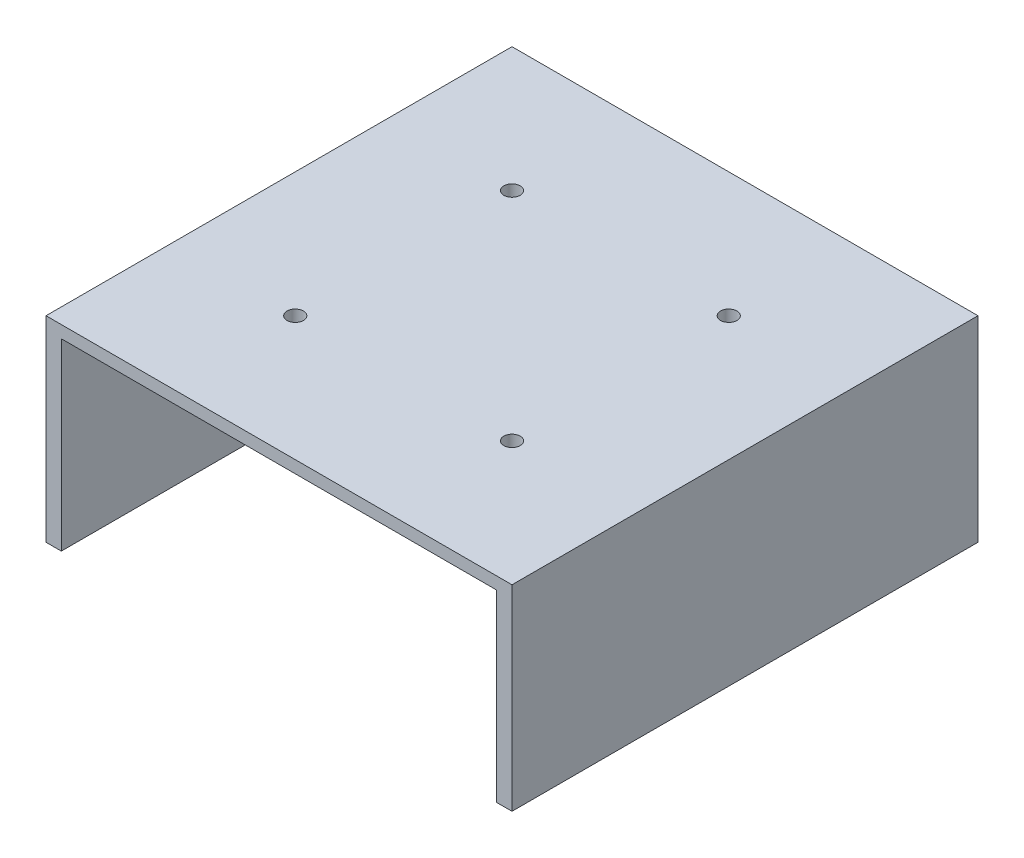
ISO-10303-21;
HEADER;
FILE_DESCRIPTION(('STEP AP214'),'2;1');
FILE_NAME('part.step','',(''),(''),'','','');
FILE_SCHEMA(('AUTOMOTIVE_DESIGN { 1 0 10303 214 1 1 1 1 }'));
ENDSEC;
DATA;
#1=APPLICATION_CONTEXT('core data for automotive mechanical design processes');
#2=APPLICATION_PROTOCOL_DEFINITION('international standard','automotive_design',2000,#1);
#3=PRODUCT_CONTEXT('',#1,'mechanical');
#4=PRODUCT('Part','Part','',(#3));
#5=PRODUCT_RELATED_PRODUCT_CATEGORY('part','',(#4));
#6=PRODUCT_DEFINITION_FORMATION('','',#4);
#7=PRODUCT_DEFINITION_CONTEXT('part definition',#1,'design');
#8=PRODUCT_DEFINITION('design','',#6,#7);
#9=PRODUCT_DEFINITION_SHAPE('','',#8);
#10=(LENGTH_UNIT() NAMED_UNIT(*) SI_UNIT(.MILLI.,.METRE.));
#11=(NAMED_UNIT(*) PLANE_ANGLE_UNIT() SI_UNIT($,.RADIAN.));
#12=(NAMED_UNIT(*) SI_UNIT($,.STERADIAN.) SOLID_ANGLE_UNIT());
#13=UNCERTAINTY_MEASURE_WITH_UNIT(LENGTH_MEASURE(1.E-05),#10,'distance_accuracy_value','');
#14=(GEOMETRIC_REPRESENTATION_CONTEXT(3) GLOBAL_UNCERTAINTY_ASSIGNED_CONTEXT((#13)) GLOBAL_UNIT_ASSIGNED_CONTEXT((#10,
#11,#12)) REPRESENTATION_CONTEXT('',''));
#15=CARTESIAN_POINT('',(0.,0.,0.));
#16=DIRECTION('',(0.,0.,1.));
#17=DIRECTION('',(1.,0.,0.));
#18=AXIS2_PLACEMENT_3D('',#15,#16,#17);
#19=CARTESIAN_POINT('',(0.,0.,0.));
#20=DIRECTION('',(0.,1.,0.));
#21=DIRECTION('',(0.,0.,1.));
#22=AXIS2_PLACEMENT_3D('',#19,#20,#21);
#23=PLANE('',#22);
#24=CARTESIAN_POINT('',(-22.4478830679846,0.,-22.4478830679846));
#25=DIRECTION('',(0.,1.,0.));
#26=DIRECTION('',(0.,0.,1.));
#27=AXIS2_PLACEMENT_3D('',#24,#25,#26);
#28=CIRCLE('',#27,1.7);
#29=CARTESIAN_POINT('',(-22.4478830679846,0.,-20.7478830679846));
#30=VERTEX_POINT('',#29);
#31=EDGE_CURVE('E142',#30,#30,#28,.T.);
#32=ORIENTED_EDGE('',*,*,#31,.T.);
#33=EDGE_LOOP('',(#32));
#34=FACE_BOUND('',#33,.T.);
#35=CARTESIAN_POINT('',(22.4478830679847,0.,-22.4478830679846));
#36=DIRECTION('',(0.,1.,0.));
#37=DIRECTION('',(0.,0.,1.));
#38=AXIS2_PLACEMENT_3D('',#35,#36,#37);
#39=CIRCLE('',#38,1.7);
#40=CARTESIAN_POINT('',(22.4478830679847,0.,-20.7478830679846));
#41=VERTEX_POINT('',#40);
#42=EDGE_CURVE('E204',#41,#41,#39,.T.);
#43=ORIENTED_EDGE('',*,*,#42,.T.);
#44=EDGE_LOOP('',(#43));
#45=FACE_BOUND('',#44,.T.);
#46=CARTESIAN_POINT('',(22.4478830679847,0.,22.4478830679846));
#47=DIRECTION('',(0.,1.,0.));
#48=DIRECTION('',(0.,0.,1.));
#49=AXIS2_PLACEMENT_3D('',#46,#47,#48);
#50=CIRCLE('',#49,1.7);
#51=CARTESIAN_POINT('',(22.4478830679847,0.,24.1478830679846));
#52=VERTEX_POINT('',#51);
#53=EDGE_CURVE('E196',#52,#52,#50,.T.);
#54=ORIENTED_EDGE('',*,*,#53,.T.);
#55=EDGE_LOOP('',(#54));
#56=FACE_BOUND('',#55,.T.);
#57=CARTESIAN_POINT('',(-22.4478830679847,0.,22.4478830679846));
#58=DIRECTION('',(0.,1.,0.));
#59=DIRECTION('',(0.,0.,1.));
#60=AXIS2_PLACEMENT_3D('',#57,#58,#59);
#61=CIRCLE('',#60,1.7);
#62=CARTESIAN_POINT('',(-22.4478830679847,0.,24.1478830679846));
#63=VERTEX_POINT('',#62);
#64=EDGE_CURVE('E191',#63,#63,#61,.T.);
#65=ORIENTED_EDGE('',*,*,#64,.T.);
#66=EDGE_LOOP('',(#65));
#67=FACE_BOUND('',#66,.T.);
#68=DIRECTION('',(0.,0.,-1.));
#69=VECTOR('',#68,1.);
#70=CARTESIAN_POINT('',(45.085,0.,48.26));
#71=LINE('',#70,#69);
#72=CARTESIAN_POINT('',(45.085,0.,48.26));
#73=VERTEX_POINT('',#72);
#74=CARTESIAN_POINT('',(45.085,0.,-48.26));
#75=VERTEX_POINT('',#74);
#76=EDGE_CURVE('E113',#73,#75,#71,.T.);
#77=ORIENTED_EDGE('',*,*,#76,.F.);
#78=DIRECTION('',(1.,0.,0.));
#79=VECTOR('',#78,1.);
#80=CARTESIAN_POINT('',(-48.26,0.,48.26));
#81=LINE('',#80,#79);
#82=CARTESIAN_POINT('',(-45.085,0.,48.26));
#83=VERTEX_POINT('',#82);
#84=EDGE_CURVE('E134',#83,#73,#81,.T.);
#85=ORIENTED_EDGE('',*,*,#84,.F.);
#86=DIRECTION('',(0.,0.,1.));
#87=VECTOR('',#86,1.);
#88=CARTESIAN_POINT('',(-45.085,0.,48.26));
#89=LINE('',#88,#87);
#90=CARTESIAN_POINT('',(-45.085,0.,-48.26));
#91=VERTEX_POINT('',#90);
#92=EDGE_CURVE('E123',#91,#83,#89,.T.);
#93=ORIENTED_EDGE('',*,*,#92,.F.);
#94=DIRECTION('',(-1.,0.,0.));
#95=VECTOR('',#94,1.);
#96=CARTESIAN_POINT('',(-48.26,0.,-48.26));
#97=LINE('',#96,#95);
#98=EDGE_CURVE('E61',#75,#91,#97,.T.);
#99=ORIENTED_EDGE('',*,*,#98,.F.);
#100=EDGE_LOOP('',(#77,#85,#93,#99));
#101=FACE_BOUND('',#100,.T.);
#102=ADVANCED_FACE('F45',(#34,#45,#56,#67,#101),#23,.F.);
#103=CARTESIAN_POINT('',(0.,2.54,0.));
#104=DIRECTION('',(0.,1.,0.));
#105=DIRECTION('',(0.,0.,1.));
#106=AXIS2_PLACEMENT_3D('',#103,#104,#105);
#107=PLANE('',#106);
#108=CARTESIAN_POINT('',(22.4478830679847,2.54,22.4478830679846));
#109=DIRECTION('',(0.,1.,0.));
#110=DIRECTION('',(0.,0.,1.));
#111=AXIS2_PLACEMENT_3D('',#108,#109,#110);
#112=CIRCLE('',#111,1.7);
#113=CARTESIAN_POINT('',(22.4478830679847,2.54,24.1478830679846));
#114=VERTEX_POINT('',#113);
#115=EDGE_CURVE('E200',#114,#114,#112,.T.);
#116=ORIENTED_EDGE('',*,*,#115,.F.);
#117=EDGE_LOOP('',(#116));
#118=FACE_BOUND('',#117,.T.);
#119=CARTESIAN_POINT('',(-22.4478830679846,2.54,-22.4478830679846));
#120=DIRECTION('',(0.,1.,0.));
#121=DIRECTION('',(0.,0.,1.));
#122=AXIS2_PLACEMENT_3D('',#119,#120,#121);
#123=CIRCLE('',#122,1.7);
#124=CARTESIAN_POINT('',(-22.4478830679846,2.54,-20.7478830679846));
#125=VERTEX_POINT('',#124);
#126=EDGE_CURVE('E135',#125,#125,#123,.T.);
#127=ORIENTED_EDGE('',*,*,#126,.F.);
#128=EDGE_LOOP('',(#127));
#129=FACE_BOUND('',#128,.T.);
#130=DIRECTION('',(0.,0.,-1.));
#131=VECTOR('',#130,1.);
#132=CARTESIAN_POINT('',(48.26,2.54,-48.26));
#133=LINE('',#132,#131);
#134=CARTESIAN_POINT('',(48.26,2.54,48.26));
#135=VERTEX_POINT('',#134);
#136=CARTESIAN_POINT('',(48.26,2.54,-48.26));
#137=VERTEX_POINT('',#136);
#138=EDGE_CURVE('E139',#135,#137,#133,.T.);
#139=ORIENTED_EDGE('',*,*,#138,.T.);
#140=DIRECTION('',(-1.,0.,0.));
#141=VECTOR('',#140,1.);
#142=CARTESIAN_POINT('',(-48.26,2.54,-48.26));
#143=LINE('',#142,#141);
#144=CARTESIAN_POINT('',(-48.26,2.54,-48.26));
#145=VERTEX_POINT('',#144);
#146=EDGE_CURVE('E220',#137,#145,#143,.T.);
#147=ORIENTED_EDGE('',*,*,#146,.T.);
#148=DIRECTION('',(0.,0.,1.));
#149=VECTOR('',#148,1.);
#150=CARTESIAN_POINT('',(-48.26,2.54,-48.26));
#151=LINE('',#150,#149);
#152=CARTESIAN_POINT('',(-48.26,2.54,48.26));
#153=VERTEX_POINT('',#152);
#154=EDGE_CURVE('E162',#145,#153,#151,.T.);
#155=ORIENTED_EDGE('',*,*,#154,.T.);
#156=DIRECTION('',(1.,0.,0.));
#157=VECTOR('',#156,1.);
#158=CARTESIAN_POINT('',(-48.26,2.54,48.26));
#159=LINE('',#158,#157);
#160=EDGE_CURVE('E69',#153,#135,#159,.T.);
#161=ORIENTED_EDGE('',*,*,#160,.T.);
#162=EDGE_LOOP('',(#139,#147,#155,#161));
#163=FACE_BOUND('',#162,.T.);
#164=CARTESIAN_POINT('',(22.4478830679847,2.54,-22.4478830679846));
#165=DIRECTION('',(0.,1.,0.));
#166=DIRECTION('',(0.,0.,1.));
#167=AXIS2_PLACEMENT_3D('',#164,#165,#166);
#168=CIRCLE('',#167,1.7);
#169=CARTESIAN_POINT('',(22.4478830679847,2.54,-20.7478830679846));
#170=VERTEX_POINT('',#169);
#171=EDGE_CURVE('E208',#170,#170,#168,.T.);
#172=ORIENTED_EDGE('',*,*,#171,.F.);
#173=EDGE_LOOP('',(#172));
#174=FACE_BOUND('',#173,.T.);
#175=CARTESIAN_POINT('',(-22.4478830679847,2.54,22.4478830679846));
#176=DIRECTION('',(0.,1.,0.));
#177=DIRECTION('',(0.,0.,1.));
#178=AXIS2_PLACEMENT_3D('',#175,#176,#177);
#179=CIRCLE('',#178,1.7);
#180=CARTESIAN_POINT('',(-22.4478830679847,2.54,24.1478830679846));
#181=VERTEX_POINT('',#180);
#182=EDGE_CURVE('E192',#181,#181,#179,.T.);
#183=ORIENTED_EDGE('',*,*,#182,.F.);
#184=EDGE_LOOP('',(#183));
#185=FACE_BOUND('',#184,.T.);
#186=ADVANCED_FACE('F224',(#118,#129,#163,#174,#185),#107,.T.);
#187=CARTESIAN_POINT('',(48.26,2.54,-48.26));
#188=DIRECTION('',(-1.,0.,0.));
#189=DIRECTION('',(0.,0.,1.));
#190=AXIS2_PLACEMENT_3D('',#187,#188,#189);
#191=PLANE('',#190);
#192=DIRECTION('',(0.,-1.,0.));
#193=VECTOR('',#192,1.);
#194=CARTESIAN_POINT('',(48.26,2.54,48.26));
#195=LINE('',#194,#193);
#196=CARTESIAN_POINT('',(48.26,-38.1,48.26));
#197=VERTEX_POINT('',#196);
#198=EDGE_CURVE('E147',#135,#197,#195,.T.);
#199=ORIENTED_EDGE('',*,*,#198,.T.);
#200=DIRECTION('',(0.,0.,1.));
#201=VECTOR('',#200,1.);
#202=CARTESIAN_POINT('',(48.26,-38.1,48.26));
#203=LINE('',#202,#201);
#204=CARTESIAN_POINT('',(48.26,-38.1,-48.26));
#205=VERTEX_POINT('',#204);
#206=EDGE_CURVE('E124',#205,#197,#203,.T.);
#207=ORIENTED_EDGE('',*,*,#206,.F.);
#208=DIRECTION('',(0.,-1.,0.));
#209=VECTOR('',#208,1.);
#210=CARTESIAN_POINT('',(48.26,2.54,-48.26));
#211=LINE('',#210,#209);
#212=EDGE_CURVE('E11',#137,#205,#211,.T.);
#213=ORIENTED_EDGE('',*,*,#212,.F.);
#214=ORIENTED_EDGE('',*,*,#138,.F.);
#215=EDGE_LOOP('',(#199,#207,#213,#214));
#216=FACE_BOUND('',#215,.T.);
#217=ADVANCED_FACE('F47',(#216),#191,.F.);
#218=CARTESIAN_POINT('',(-48.26,2.54,-48.26));
#219=DIRECTION('',(0.,0.,1.));
#220=DIRECTION('',(1.,0.,0.));
#221=AXIS2_PLACEMENT_3D('',#218,#219,#220);
#222=PLANE('',#221);
#223=ORIENTED_EDGE('',*,*,#212,.T.);
#224=DIRECTION('',(1.,0.,0.));
#225=VECTOR('',#224,1.);
#226=CARTESIAN_POINT('',(48.26,-38.1,-48.26));
#227=LINE('',#226,#225);
#228=CARTESIAN_POINT('',(45.085,-38.1,-48.26));
#229=VERTEX_POINT('',#228);
#230=EDGE_CURVE('E128',#229,#205,#227,.T.);
#231=ORIENTED_EDGE('',*,*,#230,.F.);
#232=DIRECTION('',(0.,1.,0.));
#233=VECTOR('',#232,1.);
#234=CARTESIAN_POINT('',(45.085,-38.1,-48.26));
#235=LINE('',#234,#233);
#236=EDGE_CURVE('E116',#229,#75,#235,.T.);
#237=ORIENTED_EDGE('',*,*,#236,.T.);
#238=ORIENTED_EDGE('',*,*,#98,.T.);
#239=DIRECTION('',(0.,1.,0.));
#240=VECTOR('',#239,1.);
#241=CARTESIAN_POINT('',(-45.085,-38.1,-48.26));
#242=LINE('',#241,#240);
#243=CARTESIAN_POINT('',(-45.085,-38.1,-48.26));
#244=VERTEX_POINT('',#243);
#245=EDGE_CURVE('E164',#244,#91,#242,.T.);
#246=ORIENTED_EDGE('',*,*,#245,.F.);
#247=DIRECTION('',(1.,0.,0.));
#248=VECTOR('',#247,1.);
#249=CARTESIAN_POINT('',(-48.26,-38.1,-48.26));
#250=LINE('',#249,#248);
#251=CARTESIAN_POINT('',(-48.26,-38.1,-48.26));
#252=VERTEX_POINT('',#251);
#253=EDGE_CURVE('E163',#252,#244,#250,.T.);
#254=ORIENTED_EDGE('',*,*,#253,.F.);
#255=DIRECTION('',(0.,-1.,0.));
#256=VECTOR('',#255,1.);
#257=CARTESIAN_POINT('',(-48.26,2.54,-48.26));
#258=LINE('',#257,#256);
#259=EDGE_CURVE('E54',#145,#252,#258,.T.);
#260=ORIENTED_EDGE('',*,*,#259,.F.);
#261=ORIENTED_EDGE('',*,*,#146,.F.);
#262=EDGE_LOOP('',(#223,#231,#237,#238,#246,#254,#260,#261));
#263=FACE_BOUND('',#262,.T.);
#264=ADVANCED_FACE('F126',(#263),#222,.F.);
#265=CARTESIAN_POINT('',(-48.26,2.54,-48.26));
#266=DIRECTION('',(1.,0.,0.));
#267=DIRECTION('',(0.,0.,-1.));
#268=AXIS2_PLACEMENT_3D('',#265,#266,#267);
#269=PLANE('',#268);
#270=ORIENTED_EDGE('',*,*,#259,.T.);
#271=DIRECTION('',(0.,0.,-1.));
#272=VECTOR('',#271,1.);
#273=CARTESIAN_POINT('',(-48.26,-38.1,48.26));
#274=LINE('',#273,#272);
#275=CARTESIAN_POINT('',(-48.26,-38.1,48.26));
#276=VERTEX_POINT('',#275);
#277=EDGE_CURVE('E161',#276,#252,#274,.T.);
#278=ORIENTED_EDGE('',*,*,#277,.F.);
#279=DIRECTION('',(0.,-1.,0.));
#280=VECTOR('',#279,1.);
#281=CARTESIAN_POINT('',(-48.26,2.54,48.26));
#282=LINE('',#281,#280);
#283=EDGE_CURVE('E150',#153,#276,#282,.T.);
#284=ORIENTED_EDGE('',*,*,#283,.F.);
#285=ORIENTED_EDGE('',*,*,#154,.F.);
#286=EDGE_LOOP('',(#270,#278,#284,#285));
#287=FACE_BOUND('',#286,.T.);
#288=ADVANCED_FACE('F158',(#287),#269,.F.);
#289=CARTESIAN_POINT('',(-48.26,2.54,48.26));
#290=DIRECTION('',(0.,0.,-1.));
#291=DIRECTION('',(-1.,0.,0.));
#292=AXIS2_PLACEMENT_3D('',#289,#290,#291);
#293=PLANE('',#292);
#294=ORIENTED_EDGE('',*,*,#283,.T.);
#295=DIRECTION('',(-1.,0.,0.));
#296=VECTOR('',#295,1.);
#297=CARTESIAN_POINT('',(-48.26,-38.1,48.26));
#298=LINE('',#297,#296);
#299=CARTESIAN_POINT('',(-45.085,-38.1,48.26));
#300=VERTEX_POINT('',#299);
#301=EDGE_CURVE('E173',#300,#276,#298,.T.);
#302=ORIENTED_EDGE('',*,*,#301,.F.);
#303=DIRECTION('',(0.,1.,0.));
#304=VECTOR('',#303,1.);
#305=CARTESIAN_POINT('',(-45.085,-38.1,48.26));
#306=LINE('',#305,#304);
#307=EDGE_CURVE('E184',#300,#83,#306,.T.);
#308=ORIENTED_EDGE('',*,*,#307,.T.);
#309=ORIENTED_EDGE('',*,*,#84,.T.);
#310=DIRECTION('',(0.,1.,0.));
#311=VECTOR('',#310,1.);
#312=CARTESIAN_POINT('',(45.085,-38.1,48.26));
#313=LINE('',#312,#311);
#314=CARTESIAN_POINT('',(45.085,-38.1,48.26));
#315=VERTEX_POINT('',#314);
#316=EDGE_CURVE('E119',#315,#73,#313,.T.);
#317=ORIENTED_EDGE('',*,*,#316,.F.);
#318=DIRECTION('',(-1.,0.,0.));
#319=VECTOR('',#318,1.);
#320=CARTESIAN_POINT('',(48.26,-38.1,48.26));
#321=LINE('',#320,#319);
#322=EDGE_CURVE('E230',#197,#315,#321,.T.);
#323=ORIENTED_EDGE('',*,*,#322,.F.);
#324=ORIENTED_EDGE('',*,*,#198,.F.);
#325=ORIENTED_EDGE('',*,*,#160,.F.);
#326=EDGE_LOOP('',(#294,#302,#308,#309,#317,#323,#324,#325));
#327=FACE_BOUND('',#326,.T.);
#328=ADVANCED_FACE('F227',(#327),#293,.F.);
#329=CARTESIAN_POINT('',(-22.4478830679846,2.54,-22.4478830679846));
#330=DIRECTION('',(0.,-1.,0.));
#331=DIRECTION('',(0.,0.,-1.));
#332=AXIS2_PLACEMENT_3D('',#329,#330,#331);
#333=CYLINDRICAL_SURFACE('',#332,1.7);
#334=ORIENTED_EDGE('',*,*,#126,.T.);
#335=EDGE_LOOP('',(#334));
#336=FACE_BOUND('',#335,.T.);
#337=ORIENTED_EDGE('',*,*,#31,.F.);
#338=EDGE_LOOP('',(#337));
#339=FACE_BOUND('',#338,.T.);
#340=ADVANCED_FACE('F274',(#336,#339),#333,.F.);
#341=CARTESIAN_POINT('',(22.4478830679847,2.54,-22.4478830679846));
#342=DIRECTION('',(0.,-1.,0.));
#343=DIRECTION('',(0.,0.,-1.));
#344=AXIS2_PLACEMENT_3D('',#341,#342,#343);
#345=CYLINDRICAL_SURFACE('',#344,1.7);
#346=ORIENTED_EDGE('',*,*,#171,.T.);
#347=EDGE_LOOP('',(#346));
#348=FACE_BOUND('',#347,.T.);
#349=ORIENTED_EDGE('',*,*,#42,.F.);
#350=EDGE_LOOP('',(#349));
#351=FACE_BOUND('',#350,.T.);
#352=ADVANCED_FACE('F357',(#348,#351),#345,.F.);
#353=CARTESIAN_POINT('',(22.4478830679847,2.54,22.4478830679846));
#354=DIRECTION('',(0.,-1.,0.));
#355=DIRECTION('',(0.,0.,-1.));
#356=AXIS2_PLACEMENT_3D('',#353,#354,#355);
#357=CYLINDRICAL_SURFACE('',#356,1.7);
#358=ORIENTED_EDGE('',*,*,#115,.T.);
#359=EDGE_LOOP('',(#358));
#360=FACE_BOUND('',#359,.T.);
#361=ORIENTED_EDGE('',*,*,#53,.F.);
#362=EDGE_LOOP('',(#361));
#363=FACE_BOUND('',#362,.T.);
#364=ADVANCED_FACE('F258',(#360,#363),#357,.F.);
#365=CARTESIAN_POINT('',(-22.4478830679847,2.54,22.4478830679846));
#366=DIRECTION('',(0.,-1.,0.));
#367=DIRECTION('',(0.,0.,-1.));
#368=AXIS2_PLACEMENT_3D('',#365,#366,#367);
#369=CYLINDRICAL_SURFACE('',#368,1.7);
#370=ORIENTED_EDGE('',*,*,#182,.T.);
#371=EDGE_LOOP('',(#370));
#372=FACE_BOUND('',#371,.T.);
#373=ORIENTED_EDGE('',*,*,#64,.F.);
#374=EDGE_LOOP('',(#373));
#375=FACE_BOUND('',#374,.T.);
#376=ADVANCED_FACE('F250',(#372,#375),#369,.F.);
#377=CARTESIAN_POINT('',(-45.085,-38.1,48.26));
#378=DIRECTION('',(-1.,0.,0.));
#379=DIRECTION('',(0.,0.,1.));
#380=AXIS2_PLACEMENT_3D('',#377,#378,#379);
#381=PLANE('',#380);
#382=ORIENTED_EDGE('',*,*,#92,.T.);
#383=ORIENTED_EDGE('',*,*,#307,.F.);
#384=DIRECTION('',(0.,0.,1.));
#385=VECTOR('',#384,1.);
#386=CARTESIAN_POINT('',(-45.085,-38.1,48.26));
#387=LINE('',#386,#385);
#388=EDGE_CURVE('E168',#244,#300,#387,.T.);
#389=ORIENTED_EDGE('',*,*,#388,.F.);
#390=ORIENTED_EDGE('',*,*,#245,.T.);
#391=EDGE_LOOP('',(#382,#383,#389,#390));
#392=FACE_BOUND('',#391,.T.);
#393=ADVANCED_FACE('F248',(#392),#381,.F.);
#394=CARTESIAN_POINT('',(0.,-38.1,0.));
#395=DIRECTION('',(0.,-1.,0.));
#396=DIRECTION('',(0.,0.,-1.));
#397=AXIS2_PLACEMENT_3D('',#394,#395,#396);
#398=PLANE('',#397);
#399=ORIENTED_EDGE('',*,*,#277,.T.);
#400=ORIENTED_EDGE('',*,*,#253,.T.);
#401=ORIENTED_EDGE('',*,*,#388,.T.);
#402=ORIENTED_EDGE('',*,*,#301,.T.);
#403=EDGE_LOOP('',(#399,#400,#401,#402));
#404=FACE_BOUND('',#403,.T.);
#405=ADVANCED_FACE('F171',(#404),#398,.T.);
#406=CARTESIAN_POINT('',(45.085,-38.1,48.26));
#407=DIRECTION('',(1.,0.,0.));
#408=DIRECTION('',(0.,0.,-1.));
#409=AXIS2_PLACEMENT_3D('',#406,#407,#408);
#410=PLANE('',#409);
#411=ORIENTED_EDGE('',*,*,#76,.T.);
#412=ORIENTED_EDGE('',*,*,#236,.F.);
#413=DIRECTION('',(0.,0.,-1.));
#414=VECTOR('',#413,1.);
#415=CARTESIAN_POINT('',(45.085,-38.1,48.26));
#416=LINE('',#415,#414);
#417=EDGE_CURVE('E237',#315,#229,#416,.T.);
#418=ORIENTED_EDGE('',*,*,#417,.F.);
#419=ORIENTED_EDGE('',*,*,#316,.T.);
#420=EDGE_LOOP('',(#411,#412,#418,#419));
#421=FACE_BOUND('',#420,.T.);
#422=ADVANCED_FACE('F114',(#421),#410,.F.);
#423=CARTESIAN_POINT('',(0.,-38.1,0.));
#424=DIRECTION('',(0.,1.,0.));
#425=DIRECTION('',(0.,0.,1.));
#426=AXIS2_PLACEMENT_3D('',#423,#424,#425);
#427=PLANE('',#426);
#428=ORIENTED_EDGE('',*,*,#206,.T.);
#429=ORIENTED_EDGE('',*,*,#322,.T.);
#430=ORIENTED_EDGE('',*,*,#417,.T.);
#431=ORIENTED_EDGE('',*,*,#230,.T.);
#432=EDGE_LOOP('',(#428,#429,#430,#431));
#433=FACE_BOUND('',#432,.T.);
#434=ADVANCED_FACE('F236',(#433),#427,.F.);
#435=CLOSED_SHELL('',(#102,#186,#217,#264,#288,#328,#340,#352,#364,#376,#393,#405,#422,#434));
#436=MANIFOLD_SOLID_BREP('B2',#435);
#437=ADVANCED_BREP_SHAPE_REPRESENTATION('',(#18,#436),#14);
#438=SHAPE_DEFINITION_REPRESENTATION(#9,#437);
ENDSEC;
END-ISO-10303-21;
